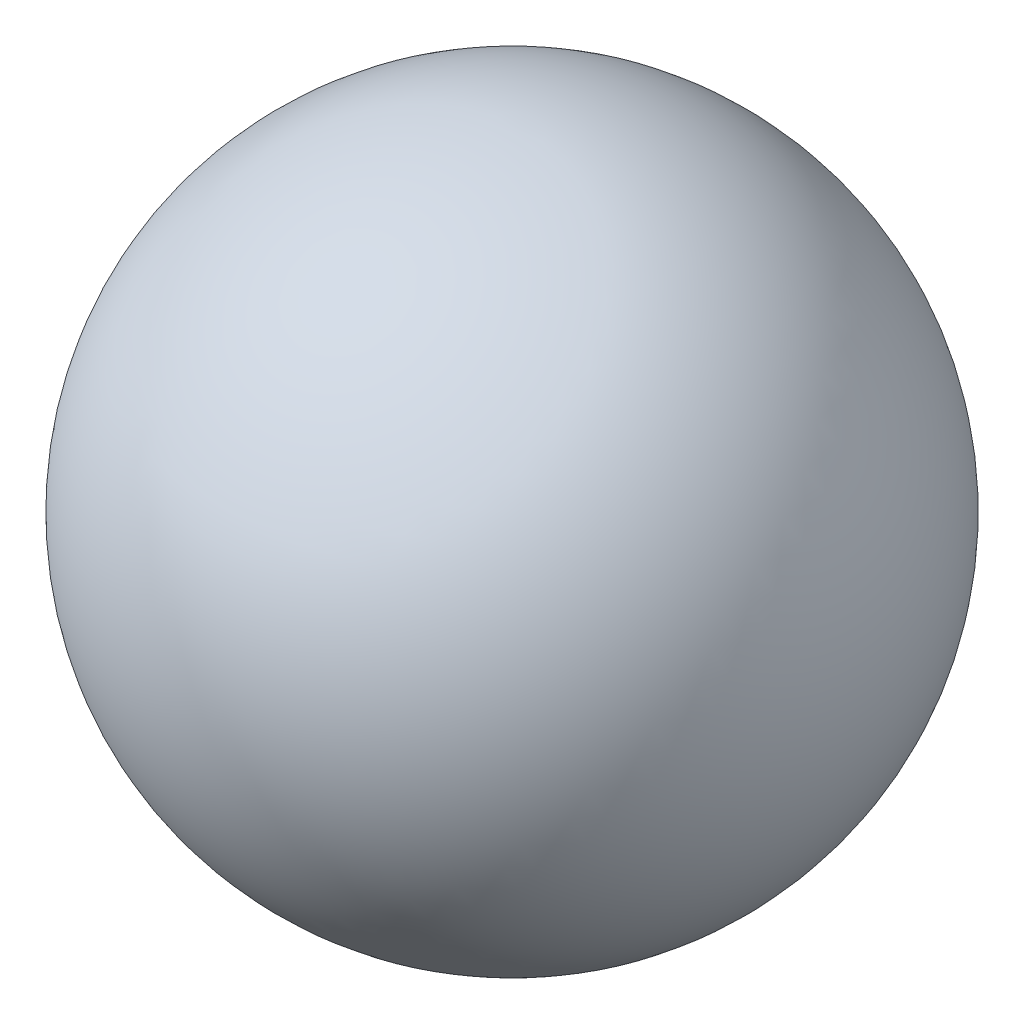
ISO-10303-21;
HEADER;
FILE_DESCRIPTION(('STEP AP214'),'2;1');
FILE_NAME('part.step','',(''),(''),'','','');
FILE_SCHEMA(('AUTOMOTIVE_DESIGN { 1 0 10303 214 1 1 1 1 }'));
ENDSEC;
DATA;
#1=APPLICATION_CONTEXT('core data for automotive mechanical design processes');
#2=APPLICATION_PROTOCOL_DEFINITION('international standard','automotive_design',2000,#1);
#3=PRODUCT_CONTEXT('',#1,'mechanical');
#4=PRODUCT('Part','Part','',(#3));
#5=PRODUCT_RELATED_PRODUCT_CATEGORY('part','',(#4));
#6=PRODUCT_DEFINITION_FORMATION('','',#4);
#7=PRODUCT_DEFINITION_CONTEXT('part definition',#1,'design');
#8=PRODUCT_DEFINITION('design','',#6,#7);
#9=PRODUCT_DEFINITION_SHAPE('','',#8);
#10=(LENGTH_UNIT() NAMED_UNIT(*) SI_UNIT(.MILLI.,.METRE.));
#11=(NAMED_UNIT(*) PLANE_ANGLE_UNIT() SI_UNIT($,.RADIAN.));
#12=(NAMED_UNIT(*) SI_UNIT($,.STERADIAN.) SOLID_ANGLE_UNIT());
#13=UNCERTAINTY_MEASURE_WITH_UNIT(LENGTH_MEASURE(1.E-05),#10,'distance_accuracy_value','');
#14=(GEOMETRIC_REPRESENTATION_CONTEXT(3) GLOBAL_UNCERTAINTY_ASSIGNED_CONTEXT((#13)) GLOBAL_UNIT_ASSIGNED_CONTEXT((#10,
#11,#12)) REPRESENTATION_CONTEXT('',''));
#15=CARTESIAN_POINT('',(0.,0.,0.));
#16=DIRECTION('',(0.,0.,1.));
#17=DIRECTION('',(1.,0.,0.));
#18=AXIS2_PLACEMENT_3D('',#15,#16,#17);
#19=CARTESIAN_POINT('',(0.,0.,0.));
#20=DIRECTION('',(0.,1.,0.));
#21=DIRECTION('',(1.,0.,0.));
#22=AXIS2_PLACEMENT_3D('',#19,#20,#21);
#23=SPHERICAL_SURFACE('',#22,80.);
#24=CARTESIAN_POINT('',(0.,80.,0.));
#25=VERTEX_POINT('',#24);
#26=VERTEX_LOOP('',#25);
#27=FACE_BOUND('',#26,.T.);
#28=ADVANCED_FACE('F33',(#27),#23,.T.);
#29=CLOSED_SHELL('',(#28));
#30=MANIFOLD_SOLID_BREP('B2',#29);
#31=ADVANCED_BREP_SHAPE_REPRESENTATION('',(#18,#30),#14);
#32=SHAPE_DEFINITION_REPRESENTATION(#9,#31);
ENDSEC;
END-ISO-10303-21;
